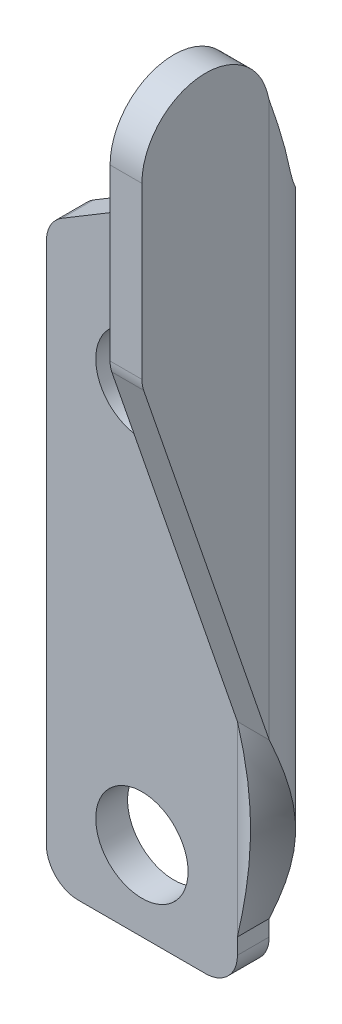
ISO-10303-21;
HEADER;
FILE_DESCRIPTION(('STEP AP214'),'2;1');
FILE_NAME('part.step','',(''),(''),'','','');
FILE_SCHEMA(('AUTOMOTIVE_DESIGN { 1 0 10303 214 1 1 1 1 }'));
ENDSEC;
DATA;
#1=APPLICATION_CONTEXT('core data for automotive mechanical design processes');
#2=APPLICATION_PROTOCOL_DEFINITION('international standard','automotive_design',2000,#1);
#3=PRODUCT_CONTEXT('',#1,'mechanical');
#4=PRODUCT('Part','Part','',(#3));
#5=PRODUCT_RELATED_PRODUCT_CATEGORY('part','',(#4));
#6=PRODUCT_DEFINITION_FORMATION('','',#4);
#7=PRODUCT_DEFINITION_CONTEXT('part definition',#1,'design');
#8=PRODUCT_DEFINITION('design','',#6,#7);
#9=PRODUCT_DEFINITION_SHAPE('','',#8);
#10=(LENGTH_UNIT() NAMED_UNIT(*) SI_UNIT(.MILLI.,.METRE.));
#11=(NAMED_UNIT(*) PLANE_ANGLE_UNIT() SI_UNIT($,.RADIAN.));
#12=(NAMED_UNIT(*) SI_UNIT($,.STERADIAN.) SOLID_ANGLE_UNIT());
#13=UNCERTAINTY_MEASURE_WITH_UNIT(LENGTH_MEASURE(1.E-05),#10,'distance_accuracy_value','');
#14=(GEOMETRIC_REPRESENTATION_CONTEXT(3) GLOBAL_UNCERTAINTY_ASSIGNED_CONTEXT((#13)) GLOBAL_UNIT_ASSIGNED_CONTEXT((#10,
#11,#12)) REPRESENTATION_CONTEXT('',''));
#15=CARTESIAN_POINT('',(0.,0.,0.));
#16=DIRECTION('',(0.,0.,1.));
#17=DIRECTION('',(1.,0.,0.));
#18=AXIS2_PLACEMENT_3D('',#15,#16,#17);
#19=CARTESIAN_POINT('',(-2.,55.,0.));
#20=DIRECTION('',(1.,0.,0.));
#21=DIRECTION('',(0.,0.,-1.));
#22=AXIS2_PLACEMENT_3D('',#19,#20,#21);
#23=PLANE('',#22);
#24=DIRECTION('',(0.,-0.945736572282818,-0.324934356211754));
#25=VECTOR('',#24,1.);
#26=CARTESIAN_POINT('',(-2.,40.,12.));
#27=LINE('',#26,#25);
#28=CARTESIAN_POINT('',(-2.,39.6841275343865,11.8914731445656));
#29=VERTEX_POINT('',#28);
#30=CARTESIAN_POINT('',(-2.,16.7156275302203,4.));
#31=VERTEX_POINT('',#30);
#32=EDGE_CURVE('E603',#29,#31,#27,.T.);
#33=ORIENTED_EDGE('',*,*,#32,.F.);
#34=CARTESIAN_POINT('',(-2.,40.33399624681,10.));
#35=DIRECTION('',(1.,0.,0.));
#36=DIRECTION('',(0.,0.,-1.));
#37=AXIS2_PLACEMENT_3D('',#34,#35,#36);
#38=CIRCLE('',#37,2.);
#39=CARTESIAN_POINT('',(-2.,40.33399624681,12.));
#40=VERTEX_POINT('',#39);
#41=EDGE_CURVE('E598',#29,#40,#38,.F.);
#42=ORIENTED_EDGE('',*,*,#41,.T.);
#43=DIRECTION('',(0.,-1.,0.));
#44=VECTOR('',#43,1.);
#45=CARTESIAN_POINT('',(-2.,55.,12.));
#46=LINE('',#45,#44);
#47=CARTESIAN_POINT('',(-2.,51.,12.));
#48=VERTEX_POINT('',#47);
#49=EDGE_CURVE('E310',#48,#40,#46,.T.);
#50=ORIENTED_EDGE('',*,*,#49,.F.);
#51=CARTESIAN_POINT('',(-2.,51.,8.));
#52=DIRECTION('',(1.,0.,0.));
#53=DIRECTION('',(0.,0.,-1.));
#54=AXIS2_PLACEMENT_3D('',#51,#52,#53);
#55=CIRCLE('',#54,4.);
#56=CARTESIAN_POINT('',(-2.,52.0352761804101,4.13629669484373));
#57=VERTEX_POINT('',#56);
#58=EDGE_CURVE('E298',#57,#48,#55,.T.);
#59=ORIENTED_EDGE('',*,*,#58,.F.);
#60=DIRECTION('',(0.,0.965925826289068,0.258819045102522));
#61=VECTOR('',#60,1.);
#62=CARTESIAN_POINT('',(-2.,52.0352761804101,4.13629669484373));
#63=LINE('',#62,#61);
#64=CARTESIAN_POINT('',(-2.,51.5266099903496,4.));
#65=VERTEX_POINT('',#64);
#66=EDGE_CURVE('E300',#65,#57,#63,.T.);
#67=ORIENTED_EDGE('',*,*,#66,.F.);
#68=DIRECTION('',(0.,-1.,0.));
#69=VECTOR('',#68,1.);
#70=CARTESIAN_POINT('',(-2.,55.,4.));
#71=LINE('',#70,#69);
#72=EDGE_CURVE('E335',#65,#31,#71,.T.);
#73=ORIENTED_EDGE('',*,*,#72,.T.);
#74=EDGE_LOOP('',(#33,#42,#50,#59,#67,#73));
#75=FACE_BOUND('',#74,.T.);
#76=ADVANCED_FACE('F73',(#75),#23,.F.);
#77=CARTESIAN_POINT('',(0.,55.,12.));
#78=DIRECTION('',(0.,0.,1.));
#79=DIRECTION('',(1.,0.,0.));
#80=AXIS2_PLACEMENT_3D('',#77,#78,#79);
#81=PLANE('',#80);
#82=ORIENTED_EDGE('',*,*,#49,.T.);
#83=DIRECTION('',(-1.,0.,0.));
#84=VECTOR('',#83,1.);
#85=CARTESIAN_POINT('',(0.,40.33399624681,12.));
#86=LINE('',#85,#84);
#87=CARTESIAN_POINT('',(0.,40.33399624681,12.));
#88=VERTEX_POINT('',#87);
#89=EDGE_CURVE('E594',#40,#88,#86,.F.);
#90=ORIENTED_EDGE('',*,*,#89,.T.);
#91=DIRECTION('',(0.,-1.,0.));
#92=VECTOR('',#91,1.);
#93=CARTESIAN_POINT('',(0.,55.,12.));
#94=LINE('',#93,#92);
#95=CARTESIAN_POINT('',(0.,51.,12.));
#96=VERTEX_POINT('',#95);
#97=EDGE_CURVE('E304',#96,#88,#94,.T.);
#98=ORIENTED_EDGE('',*,*,#97,.F.);
#99=DIRECTION('',(-1.,0.,0.));
#100=VECTOR('',#99,1.);
#101=CARTESIAN_POINT('',(0.,51.,12.));
#102=LINE('',#101,#100);
#103=EDGE_CURVE('E301',#96,#48,#102,.T.);
#104=ORIENTED_EDGE('',*,*,#103,.T.);
#105=EDGE_LOOP('',(#82,#90,#98,#104));
#106=FACE_BOUND('',#105,.T.);
#107=ADVANCED_FACE('F365',(#106),#81,.T.);
#108=CARTESIAN_POINT('',(0.,55.,0.));
#109=DIRECTION('',(1.,0.,0.));
#110=DIRECTION('',(0.,0.,-1.));
#111=AXIS2_PLACEMENT_3D('',#108,#109,#110);
#112=PLANE('',#111);
#113=ORIENTED_EDGE('',*,*,#97,.T.);
#114=CARTESIAN_POINT('',(0.,40.33399624681,10.));
#115=DIRECTION('',(1.,0.,0.));
#116=DIRECTION('',(0.,0.,-1.));
#117=AXIS2_PLACEMENT_3D('',#114,#115,#116);
#118=CIRCLE('',#117,2.);
#119=CARTESIAN_POINT('',(0.,39.6841275343865,11.8914731445656));
#120=VERTEX_POINT('',#119);
#121=EDGE_CURVE('E593',#88,#120,#118,.T.);
#122=ORIENTED_EDGE('',*,*,#121,.T.);
#123=DIRECTION('',(0.,-0.945736572282818,-0.324934356211754));
#124=VECTOR('',#123,1.);
#125=CARTESIAN_POINT('',(0.,40.,12.));
#126=LINE('',#125,#124);
#127=CARTESIAN_POINT('',(0.,16.7156275302203,4.));
#128=VERTEX_POINT('',#127);
#129=EDGE_CURVE('E286',#120,#128,#126,.T.);
#130=ORIENTED_EDGE('',*,*,#129,.T.);
#131=DIRECTION('',(0.,-1.,0.));
#132=VECTOR('',#131,1.);
#133=CARTESIAN_POINT('',(0.,55.,4.));
#134=LINE('',#133,#132);
#135=CARTESIAN_POINT('',(0.,51.5266099903496,4.));
#136=VERTEX_POINT('',#135);
#137=EDGE_CURVE('E220',#136,#128,#134,.T.);
#138=ORIENTED_EDGE('',*,*,#137,.F.);
#139=DIRECTION('',(0.,0.965925826289068,0.258819045102522));
#140=VECTOR('',#139,1.);
#141=CARTESIAN_POINT('',(0.,52.0352761804101,4.13629669484373));
#142=LINE('',#141,#140);
#143=CARTESIAN_POINT('',(0.,52.0352761804101,4.13629669484373));
#144=VERTEX_POINT('',#143);
#145=EDGE_CURVE('E297',#136,#144,#142,.T.);
#146=ORIENTED_EDGE('',*,*,#145,.T.);
#147=CARTESIAN_POINT('',(0.,51.,8.));
#148=DIRECTION('',(1.,0.,0.));
#149=DIRECTION('',(0.,0.,-1.));
#150=AXIS2_PLACEMENT_3D('',#147,#148,#149);
#151=CIRCLE('',#150,4.);
#152=EDGE_CURVE('E293',#144,#96,#151,.T.);
#153=ORIENTED_EDGE('',*,*,#152,.T.);
#154=EDGE_LOOP('',(#113,#122,#130,#138,#146,#153));
#155=FACE_BOUND('',#154,.T.);
#156=ADVANCED_FACE('F370',(#155),#112,.T.);
#157=CARTESIAN_POINT('',(0.,51.,8.));
#158=DIRECTION('',(-1.,0.,0.));
#159=DIRECTION('',(0.,0.,1.));
#160=AXIS2_PLACEMENT_3D('',#157,#158,#159);
#161=CYLINDRICAL_SURFACE('',#160,4.);
#162=ORIENTED_EDGE('',*,*,#58,.T.);
#163=ORIENTED_EDGE('',*,*,#103,.F.);
#164=ORIENTED_EDGE('',*,*,#152,.F.);
#165=DIRECTION('',(-1.,0.,0.));
#166=VECTOR('',#165,1.);
#167=CARTESIAN_POINT('',(0.,52.0352761804101,4.13629669484373));
#168=LINE('',#167,#166);
#169=EDGE_CURVE('E296',#144,#57,#168,.T.);
#170=ORIENTED_EDGE('',*,*,#169,.T.);
#171=EDGE_LOOP('',(#162,#163,#164,#170));
#172=FACE_BOUND('',#171,.T.);
#173=ADVANCED_FACE('F348',(#172),#161,.T.);
#174=CARTESIAN_POINT('',(0.,52.0352761804101,4.13629669484373));
#175=DIRECTION('',(0.,-0.258819045102522,0.965925826289068));
#176=DIRECTION('',(0.,0.965925826289068,0.258819045102522));
#177=AXIS2_PLACEMENT_3D('',#174,#175,#176);
#178=PLANE('',#177);
#179=CARTESIAN_POINT('',(-2.,51.5266099903496,4.));
#180=CARTESIAN_POINT('',(0.,51.5266099903496,4.));
#181=B_SPLINE_CURVE_WITH_KNOTS('',1,(#179,#180),.UNSPECIFIED.,.F.,.F.,(2,2),(0.,1.),.UNSPECIFIED.);
#182=EDGE_CURVE('E329',#65,#136,#181,.T.);
#183=ORIENTED_EDGE('',*,*,#182,.F.);
#184=ORIENTED_EDGE('',*,*,#66,.T.);
#185=ORIENTED_EDGE('',*,*,#169,.F.);
#186=ORIENTED_EDGE('',*,*,#145,.F.);
#187=EDGE_LOOP('',(#183,#184,#185,#186));
#188=FACE_BOUND('',#187,.T.);
#189=ADVANCED_FACE('F337',(#188),#178,.F.);
#190=CARTESIAN_POINT('',(0.,40.,12.));
#191=DIRECTION('',(0.,0.324934356211754,-0.945736572282818));
#192=DIRECTION('',(0.,-0.945736572282818,-0.324934356211754));
#193=AXIS2_PLACEMENT_3D('',#190,#191,#192);
#194=PLANE('',#193);
#195=ORIENTED_EDGE('',*,*,#129,.F.);
#196=DIRECTION('',(-1.,0.,0.));
#197=VECTOR('',#196,1.);
#198=CARTESIAN_POINT('',(-2.,39.6841275343865,11.8914731445656));
#199=LINE('',#198,#197);
#200=EDGE_CURVE('E600',#120,#29,#199,.T.);
#201=ORIENTED_EDGE('',*,*,#200,.T.);
#202=ORIENTED_EDGE('',*,*,#32,.T.);
#203=CARTESIAN_POINT('',(0.,16.7156275302203,4.));
#204=CARTESIAN_POINT('',(-2.,16.7156275302203,4.));
#205=B_SPLINE_CURVE_WITH_KNOTS('',1,(#203,#204),.UNSPECIFIED.,.F.,.F.,(2,2),(0.,1.),.UNSPECIFIED.);
#206=EDGE_CURVE('E316',#128,#31,#205,.T.);
#207=ORIENTED_EDGE('',*,*,#206,.F.);
#208=EDGE_LOOP('',(#195,#201,#202,#207));
#209=FACE_BOUND('',#208,.T.);
#210=ADVANCED_FACE('F347',(#209),#194,.F.);
#211=CARTESIAN_POINT('',(-10.,30.,2.));
#212=DIRECTION('',(0.,0.,1.));
#213=DIRECTION('',(1.,0.,0.));
#214=AXIS2_PLACEMENT_3D('',#211,#212,#213);
#215=CYLINDRICAL_SURFACE('',#214,2.9);
#216=CARTESIAN_POINT('',(-10.,30.,0.));
#217=DIRECTION('',(0.,0.,1.));
#218=DIRECTION('',(1.,0.,0.));
#219=AXIS2_PLACEMENT_3D('',#216,#217,#218);
#220=CIRCLE('',#219,2.9);
#221=CARTESIAN_POINT('',(-7.1,30.,0.));
#222=VERTEX_POINT('',#221);
#223=EDGE_CURVE('E404',#222,#222,#220,.T.);
#224=ORIENTED_EDGE('',*,*,#223,.F.);
#225=EDGE_LOOP('',(#224));
#226=FACE_BOUND('',#225,.T.);
#227=CARTESIAN_POINT('',(-10.,30.,2.));
#228=DIRECTION('',(0.,0.,1.));
#229=DIRECTION('',(1.,0.,0.));
#230=AXIS2_PLACEMENT_3D('',#227,#228,#229);
#231=CIRCLE('',#230,2.9);
#232=CARTESIAN_POINT('',(-7.1,30.,2.));
#233=VERTEX_POINT('',#232);
#234=EDGE_CURVE('E410',#233,#233,#231,.T.);
#235=ORIENTED_EDGE('',*,*,#234,.T.);
#236=EDGE_LOOP('',(#235));
#237=FACE_BOUND('',#236,.T.);
#238=ADVANCED_FACE('F804',(#226,#237),#215,.F.);
#239=CARTESIAN_POINT('',(-10.,5.,2.));
#240=DIRECTION('',(0.,0.,1.));
#241=DIRECTION('',(1.,0.,0.));
#242=AXIS2_PLACEMENT_3D('',#239,#240,#241);
#243=CYLINDRICAL_SURFACE('',#242,2.9);
#244=CARTESIAN_POINT('',(-10.,5.,0.));
#245=DIRECTION('',(0.,0.,1.));
#246=DIRECTION('',(1.,0.,0.));
#247=AXIS2_PLACEMENT_3D('',#244,#245,#246);
#248=CIRCLE('',#247,2.9);
#249=CARTESIAN_POINT('',(-7.1,5.,0.));
#250=VERTEX_POINT('',#249);
#251=EDGE_CURVE('E232',#250,#250,#248,.T.);
#252=ORIENTED_EDGE('',*,*,#251,.F.);
#253=EDGE_LOOP('',(#252));
#254=FACE_BOUND('',#253,.T.);
#255=CARTESIAN_POINT('',(-10.,5.,2.));
#256=DIRECTION('',(0.,0.,1.));
#257=DIRECTION('',(1.,0.,0.));
#258=AXIS2_PLACEMENT_3D('',#255,#256,#257);
#259=CIRCLE('',#258,2.9);
#260=CARTESIAN_POINT('',(-7.1,5.,2.));
#261=VERTEX_POINT('',#260);
#262=EDGE_CURVE('E414',#261,#261,#259,.T.);
#263=ORIENTED_EDGE('',*,*,#262,.T.);
#264=EDGE_LOOP('',(#263));
#265=FACE_BOUND('',#264,.T.);
#266=ADVANCED_FACE('F793',(#254,#265),#243,.F.);
#267=CARTESIAN_POINT('',(-16.,55.,2.));
#268=DIRECTION('',(-1.,0.,0.));
#269=DIRECTION('',(0.,0.,1.));
#270=AXIS2_PLACEMENT_3D('',#267,#268,#269);
#271=PLANE('',#270);
#272=DIRECTION('',(0.,-1.,0.));
#273=VECTOR('',#272,1.);
#274=CARTESIAN_POINT('',(-16.,55.,0.));
#275=LINE('',#274,#273);
#276=CARTESIAN_POINT('',(-16.,34.8690355517294,0.));
#277=VERTEX_POINT('',#276);
#278=CARTESIAN_POINT('',(-16.,2.,0.));
#279=VERTEX_POINT('',#278);
#280=EDGE_CURVE('E261',#277,#279,#275,.T.);
#281=ORIENTED_EDGE('',*,*,#280,.T.);
#282=DIRECTION('',(0.,0.,-1.));
#283=VECTOR('',#282,1.);
#284=CARTESIAN_POINT('',(-16.,2.,2.));
#285=LINE('',#284,#283);
#286=CARTESIAN_POINT('',(-16.,2.,2.));
#287=VERTEX_POINT('',#286);
#288=EDGE_CURVE('E81',#279,#287,#285,.F.);
#289=ORIENTED_EDGE('',*,*,#288,.T.);
#290=DIRECTION('',(0.,-1.,0.));
#291=VECTOR('',#290,1.);
#292=CARTESIAN_POINT('',(-16.,55.,2.));
#293=LINE('',#292,#291);
#294=CARTESIAN_POINT('',(-16.,34.8690355517294,2.));
#295=VERTEX_POINT('',#294);
#296=EDGE_CURVE('E207',#295,#287,#293,.T.);
#297=ORIENTED_EDGE('',*,*,#296,.F.);
#298=DIRECTION('',(0.,0.,1.));
#299=VECTOR('',#298,1.);
#300=CARTESIAN_POINT('',(-16.,34.8690355517294,0.));
#301=LINE('',#300,#299);
#302=EDGE_CURVE('E95',#295,#277,#301,.F.);
#303=ORIENTED_EDGE('',*,*,#302,.T.);
#304=EDGE_LOOP('',(#281,#289,#297,#303));
#305=FACE_BOUND('',#304,.T.);
#306=ADVANCED_FACE('F260',(#305),#271,.T.);
#307=CARTESIAN_POINT('',(-2.,0.,4.));
#308=DIRECTION('',(0.,-1.,0.));
#309=DIRECTION('',(0.,0.,-1.));
#310=AXIS2_PLACEMENT_3D('',#307,#308,#309);
#311=PLANE('',#310);
#312=DIRECTION('',(1.,0.,0.));
#313=VECTOR('',#312,1.);
#314=CARTESIAN_POINT('',(-16.,0.,0.));
#315=LINE('',#314,#313);
#316=CARTESIAN_POINT('',(-14.,0.,0.));
#317=VERTEX_POINT('',#316);
#318=CARTESIAN_POINT('',(-6.,0.,0.));
#319=VERTEX_POINT('',#318);
#320=EDGE_CURVE('E239',#317,#319,#315,.T.);
#321=ORIENTED_EDGE('',*,*,#320,.T.);
#322=DIRECTION('',(0.,0.,1.));
#323=VECTOR('',#322,1.);
#324=CARTESIAN_POINT('',(-6.,0.,2.));
#325=LINE('',#324,#323);
#326=CARTESIAN_POINT('',(-6.,0.,2.));
#327=VERTEX_POINT('',#326);
#328=EDGE_CURVE('E279',#319,#327,#325,.T.);
#329=ORIENTED_EDGE('',*,*,#328,.T.);
#330=DIRECTION('',(1.,0.,0.));
#331=VECTOR('',#330,1.);
#332=CARTESIAN_POINT('',(-16.,0.,2.));
#333=LINE('',#332,#331);
#334=CARTESIAN_POINT('',(-14.,0.,2.));
#335=VERTEX_POINT('',#334);
#336=EDGE_CURVE('E271',#335,#327,#333,.T.);
#337=ORIENTED_EDGE('',*,*,#336,.F.);
#338=DIRECTION('',(0.,0.,-1.));
#339=VECTOR('',#338,1.);
#340=CARTESIAN_POINT('',(-14.,0.,4.));
#341=LINE('',#340,#339);
#342=EDGE_CURVE('E276',#335,#317,#341,.T.);
#343=ORIENTED_EDGE('',*,*,#342,.T.);
#344=EDGE_LOOP('',(#321,#329,#337,#343));
#345=FACE_BOUND('',#344,.T.);
#346=ADVANCED_FACE('F592',(#345),#311,.T.);
#347=CARTESIAN_POINT('',(-16.,55.,0.));
#348=DIRECTION('',(0.,0.,-1.));
#349=DIRECTION('',(-1.,0.,0.));
#350=AXIS2_PLACEMENT_3D('',#347,#348,#349);
#351=PLANE('',#350);
#352=DIRECTION('',(0.,-1.,0.));
#353=VECTOR('',#352,1.);
#354=CARTESIAN_POINT('',(-4.,0.,0.));
#355=LINE('',#354,#353);
#356=CARTESIAN_POINT('',(-4.,3.,0.));
#357=VERTEX_POINT('',#356);
#358=CARTESIAN_POINT('',(-4.,2.,0.));
#359=VERTEX_POINT('',#358);
#360=EDGE_CURVE('E227',#357,#359,#355,.T.);
#361=ORIENTED_EDGE('',*,*,#360,.T.);
#362=CARTESIAN_POINT('',(-6.,2.,0.));
#363=DIRECTION('',(0.,0.,-1.));
#364=DIRECTION('',(-1.,0.,0.));
#365=AXIS2_PLACEMENT_3D('',#362,#363,#364);
#366=CIRCLE('',#365,2.);
#367=EDGE_CURVE('E256',#359,#319,#366,.T.);
#368=ORIENTED_EDGE('',*,*,#367,.T.);
#369=ORIENTED_EDGE('',*,*,#320,.F.);
#370=CARTESIAN_POINT('',(-14.,2.,0.));
#371=DIRECTION('',(0.,0.,-1.));
#372=DIRECTION('',(-1.,0.,0.));
#373=AXIS2_PLACEMENT_3D('',#370,#371,#372);
#374=CIRCLE('',#373,2.);
#375=EDGE_CURVE('E88',#317,#279,#374,.T.);
#376=ORIENTED_EDGE('',*,*,#375,.T.);
#377=ORIENTED_EDGE('',*,*,#280,.F.);
#378=CARTESIAN_POINT('',(-14.,34.8690355517294,0.));
#379=DIRECTION('',(0.,0.,-1.));
#380=DIRECTION('',(-1.,0.,0.));
#381=AXIS2_PLACEMENT_3D('',#378,#379,#380);
#382=CIRCLE('',#381,2.);
#383=CARTESIAN_POINT('',(-15.0308307948093,36.5829164905559,0.));
#384=VERTEX_POINT('',#383);
#385=EDGE_CURVE('E253',#277,#384,#382,.T.);
#386=ORIENTED_EDGE('',*,*,#385,.T.);
#387=DIRECTION('',(0.856940469413254,0.515415397404649,0.));
#388=VECTOR('',#387,1.);
#389=CARTESIAN_POINT('',(-16.,36.,0.));
#390=LINE('',#389,#388);
#391=CARTESIAN_POINT('',(-4.,43.2175197573417,0.));
#392=VERTEX_POINT('',#391);
#393=EDGE_CURVE('E237',#384,#392,#390,.T.);
#394=ORIENTED_EDGE('',*,*,#393,.T.);
#395=DIRECTION('',(0.,-1.,0.));
#396=VECTOR('',#395,1.);
#397=CARTESIAN_POINT('',(-4.,55.,0.));
#398=LINE('',#397,#396);
#399=EDGE_CURVE('E218',#392,#357,#398,.T.);
#400=ORIENTED_EDGE('',*,*,#399,.T.);
#401=EDGE_LOOP('',(#361,#368,#369,#376,#377,#386,#394,#400));
#402=FACE_BOUND('',#401,.T.);
#403=ORIENTED_EDGE('',*,*,#251,.T.);
#404=EDGE_LOOP('',(#403));
#405=FACE_BOUND('',#404,.T.);
#406=ORIENTED_EDGE('',*,*,#223,.T.);
#407=EDGE_LOOP('',(#406));
#408=FACE_BOUND('',#407,.T.);
#409=ADVANCED_FACE('F234',(#402,#405,#408),#351,.T.);
#410=CARTESIAN_POINT('',(-4.,0.,0.));
#411=DIRECTION('',(-1.,0.,0.));
#412=DIRECTION('',(0.,-1.,0.));
#413=AXIS2_PLACEMENT_3D('',#410,#411,#412);
#414=PLANE('',#413);
#415=DIRECTION('',(0.,-1.,0.));
#416=VECTOR('',#415,1.);
#417=CARTESIAN_POINT('',(-4.,0.,2.));
#418=LINE('',#417,#416);
#419=CARTESIAN_POINT('',(-4.,3.,2.));
#420=VERTEX_POINT('',#419);
#421=CARTESIAN_POINT('',(-4.,2.,2.));
#422=VERTEX_POINT('',#421);
#423=EDGE_CURVE('E208',#420,#422,#418,.T.);
#424=ORIENTED_EDGE('',*,*,#423,.T.);
#425=DIRECTION('',(0.,0.,1.));
#426=VECTOR('',#425,1.);
#427=CARTESIAN_POINT('',(-4.,2.,0.));
#428=LINE('',#427,#426);
#429=EDGE_CURVE('E230',#422,#359,#428,.F.);
#430=ORIENTED_EDGE('',*,*,#429,.T.);
#431=ORIENTED_EDGE('',*,*,#360,.F.);
#432=CARTESIAN_POINT('',(-4.,3.,2.));
#433=CARTESIAN_POINT('',(-4.,3.,0.));
#434=B_SPLINE_CURVE_WITH_KNOTS('',1,(#432,#433),.UNSPECIFIED.,.F.,.F.,(2,2),(0.,1.),.UNSPECIFIED.);
#435=EDGE_CURVE('E191',#357,#420,#434,.F.);
#436=ORIENTED_EDGE('',*,*,#435,.T.);
#437=EDGE_LOOP('',(#424,#430,#431,#436));
#438=FACE_BOUND('',#437,.T.);
#439=ADVANCED_FACE('F228',(#438),#414,.F.);
#440=CARTESIAN_POINT('',(-16.,55.,2.));
#441=DIRECTION('',(0.,0.,-1.));
#442=DIRECTION('',(-1.,0.,0.));
#443=AXIS2_PLACEMENT_3D('',#440,#441,#442);
#444=PLANE('',#443);
#445=ORIENTED_EDGE('',*,*,#262,.F.);
#446=EDGE_LOOP('',(#445));
#447=FACE_BOUND('',#446,.T.);
#448=ORIENTED_EDGE('',*,*,#234,.F.);
#449=EDGE_LOOP('',(#448));
#450=FACE_BOUND('',#449,.T.);
#451=ORIENTED_EDGE('',*,*,#336,.T.);
#452=CARTESIAN_POINT('',(-6.,2.,2.));
#453=DIRECTION('',(0.,0.,-1.));
#454=DIRECTION('',(-1.,0.,0.));
#455=AXIS2_PLACEMENT_3D('',#452,#453,#454);
#456=CIRCLE('',#455,2.);
#457=EDGE_CURVE('E277',#327,#422,#456,.F.);
#458=ORIENTED_EDGE('',*,*,#457,.T.);
#459=ORIENTED_EDGE('',*,*,#423,.F.);
#460=DIRECTION('',(0.,-1.,0.));
#461=VECTOR('',#460,1.);
#462=CARTESIAN_POINT('',(-4.,55.,2.));
#463=LINE('',#462,#461);
#464=CARTESIAN_POINT('',(-4.,43.2175197573417,2.));
#465=VERTEX_POINT('',#464);
#466=EDGE_CURVE('E407',#465,#420,#463,.T.);
#467=ORIENTED_EDGE('',*,*,#466,.F.);
#468=DIRECTION('',(0.856940469413254,0.515415397404649,0.));
#469=VECTOR('',#468,1.);
#470=CARTESIAN_POINT('',(-16.,36.,2.));
#471=LINE('',#470,#469);
#472=CARTESIAN_POINT('',(-15.0308307948093,36.5829164905559,2.));
#473=VERTEX_POINT('',#472);
#474=EDGE_CURVE('E282',#473,#465,#471,.T.);
#475=ORIENTED_EDGE('',*,*,#474,.F.);
#476=CARTESIAN_POINT('',(-14.,34.8690355517294,2.));
#477=DIRECTION('',(0.,0.,-1.));
#478=DIRECTION('',(-1.,0.,0.));
#479=AXIS2_PLACEMENT_3D('',#476,#477,#478);
#480=CIRCLE('',#479,2.);
#481=EDGE_CURVE('E270',#473,#295,#480,.F.);
#482=ORIENTED_EDGE('',*,*,#481,.T.);
#483=ORIENTED_EDGE('',*,*,#296,.T.);
#484=CARTESIAN_POINT('',(-14.,2.,2.));
#485=DIRECTION('',(0.,0.,-1.));
#486=DIRECTION('',(-1.,0.,0.));
#487=AXIS2_PLACEMENT_3D('',#484,#485,#486);
#488=CIRCLE('',#487,2.);
#489=EDGE_CURVE('E267',#287,#335,#488,.F.);
#490=ORIENTED_EDGE('',*,*,#489,.T.);
#491=EDGE_LOOP('',(#451,#458,#459,#467,#475,#482,#483,#490));
#492=FACE_BOUND('',#491,.T.);
#493=ADVANCED_FACE('F266',(#447,#450,#492),#444,.F.);
#494=CARTESIAN_POINT('',(-16.,36.,0.));
#495=DIRECTION('',(0.515415397404649,-0.856940469413254,0.));
#496=DIRECTION('',(0.856940469413254,0.515415397404649,0.));
#497=AXIS2_PLACEMENT_3D('',#494,#495,#496);
#498=PLANE('',#497);
#499=ORIENTED_EDGE('',*,*,#393,.F.);
#500=DIRECTION('',(0.,0.,1.));
#501=VECTOR('',#500,1.);
#502=CARTESIAN_POINT('',(-15.0308307948093,36.5829164905559,2.));
#503=LINE('',#502,#501);
#504=EDGE_CURVE('E12',#384,#473,#503,.T.);
#505=ORIENTED_EDGE('',*,*,#504,.T.);
#506=ORIENTED_EDGE('',*,*,#474,.T.);
#507=CARTESIAN_POINT('',(-4.,43.2175197573417,0.));
#508=CARTESIAN_POINT('',(-4.,43.2175197573417,2.));
#509=B_SPLINE_CURVE_WITH_KNOTS('',1,(#507,#508),.UNSPECIFIED.,.F.,.F.,(2,2),(0.,1.),.UNSPECIFIED.);
#510=EDGE_CURVE('E411',#392,#465,#509,.T.);
#511=ORIENTED_EDGE('',*,*,#510,.F.);
#512=EDGE_LOOP('',(#499,#505,#506,#511));
#513=FACE_BOUND('',#512,.T.);
#514=ADVANCED_FACE('F380',(#513),#498,.F.);
#515=CARTESIAN_POINT('',(0.,16.7156275302203,4.));
#516=CARTESIAN_POINT('',(0.,15.572622824222,3.47638484940323));
#517=CARTESIAN_POINT('',(-0.104109293326738,14.4296896085169,2.95300846256288));
#518=CARTESIAN_POINT('',(-0.50485444658297,12.1437516868135,1.9855240785164));
#519=CARTESIAN_POINT('',(-0.801332630407281,11.0007827259618,1.54181312010034));
#520=CARTESIAN_POINT('',(-1.54181312010034,8.71484480425846,0.801332630407279));
#521=CARTESIAN_POINT('',(-1.9855240785164,7.57187584340677,0.504854446582968));
#522=CARTESIAN_POINT('',(-2.95300846256288,5.28593792170339,0.104109293326737));
#523=CARTESIAN_POINT('',(-3.47638484940324,4.14300470599827,0.));
#524=CARTESIAN_POINT('',(-4.,3.,0.));
#525=CARTESIAN_POINT('',(-2.,16.7156275302203,4.));
#526=CARTESIAN_POINT('',(-2.,15.5726482966738,3.738198259219));
#527=CARTESIAN_POINT('',(-2.05205464666337,14.4296896085169,3.47650423128144));
#528=CARTESIAN_POINT('',(-2.25242722329148,12.1437516868135,2.9927620392582));
#529=CARTESIAN_POINT('',(-2.40066631520364,11.0007827259618,2.77090656005017));
#530=CARTESIAN_POINT('',(-2.77090656005017,8.71484480425846,2.40066631520364));
#531=CARTESIAN_POINT('',(-2.9927620392582,7.57187584340677,2.25242722329148));
#532=CARTESIAN_POINT('',(-3.47650423128144,5.28593792170339,2.05205464666337));
#533=CARTESIAN_POINT('',(-3.738198259219,4.14297923354652,2.));
#534=CARTESIAN_POINT('',(-4.,3.,2.));
#535=B_SPLINE_SURFACE_WITH_KNOTS('',1,3,((#515,#516,#517,#518,#519,#520,#521,#522,#523,#524),
(#525,#526,#527,#528,#529,#530,#531,#532,#533,#534)),.UNSPECIFIED.,.F.,.F.,.F.,(2,2),(4,2,2,2,
4),(0.,1.),(0.,0.25,0.5,0.75,1.),.UNSPECIFIED.);
#536=CARTESIAN_POINT('',(-2.,16.7156275302203,4.));
#537=CARTESIAN_POINT('',(-2.,15.5726482966738,3.738198259219));
#538=CARTESIAN_POINT('',(-2.05205464666337,14.4296896085169,3.47650423128144));
#539=CARTESIAN_POINT('',(-2.25242722329148,12.1437516868135,2.9927620392582));
#540=CARTESIAN_POINT('',(-2.40066631520364,11.0007827259618,2.77090656005017));
#541=CARTESIAN_POINT('',(-2.77090656005017,8.71484480425846,2.40066631520364));
#542=CARTESIAN_POINT('',(-2.9927620392582,7.57187584340677,2.25242722329148));
#543=CARTESIAN_POINT('',(-3.47650423128144,5.28593792170339,2.05205464666337));
#544=CARTESIAN_POINT('',(-3.738198259219,4.14297923354652,2.));
#545=CARTESIAN_POINT('',(-4.,3.,2.));
#546=B_SPLINE_CURVE_WITH_KNOTS('',3,(#536,#537,#538,#539,#540,#541,#542,#543,#544,#545),
.UNSPECIFIED.,.F.,.F.,(4,2,2,2,4),(0.,0.25,0.5,0.75,1.),.UNSPECIFIED.);
#547=EDGE_CURVE('E200',#31,#420,#546,.T.);
#548=CARTESIAN_POINT('',(-4.,3.,0.));
#549=CARTESIAN_POINT('',(-3.47638484940324,4.14300470599827,0.));
#550=CARTESIAN_POINT('',(-2.95300846256288,5.28593792170339,0.104109293326737));
#551=CARTESIAN_POINT('',(-1.9855240785164,7.57187584340677,0.504854446582968));
#552=CARTESIAN_POINT('',(-1.54181312010034,8.71484480425846,0.801332630407279));
#553=CARTESIAN_POINT('',(-0.801332630407281,11.0007827259618,1.54181312010034));
#554=CARTESIAN_POINT('',(-0.50485444658297,12.1437516868135,1.9855240785164));
#555=CARTESIAN_POINT('',(-0.104109293326738,14.4296896085169,2.95300846256288));
#556=CARTESIAN_POINT('',(0.,15.572622824222,3.47638484940323));
#557=CARTESIAN_POINT('',(0.,16.7156275302203,4.));
#558=B_SPLINE_CURVE_WITH_KNOTS('',3,(#548,#549,#550,#551,#552,#553,#554,#555,#556,#557),
.UNSPECIFIED.,.F.,.F.,(4,2,2,2,4),(0.,0.25,0.5,0.75,1.),.UNSPECIFIED.);
#559=EDGE_CURVE('E196',#128,#357,#558,.F.);
#560=ORIENTED_EDGE('',*,*,#206,.T.);
#561=ORIENTED_EDGE('',*,*,#547,.T.);
#562=ORIENTED_EDGE('',*,*,#435,.F.);
#563=ORIENTED_EDGE('',*,*,#559,.F.);
#564=EDGE_LOOP('',(#560,#561,#562,#563));
#565=FACE_BOUND('',#564,.T.);
#566=ADVANCED_FACE('F195',(#565),#535,.T.);
#567=CARTESIAN_POINT('',(-4.,43.2175197573417,0.));
#568=CARTESIAN_POINT('',(-3.2969608498203,43.5346571921296,0.));
#569=CARTESIAN_POINT('',(-2.59770810008145,43.8504250776799,0.188459435594551));
#570=CARTESIAN_POINT('',(-1.98988792334389,44.1675625124678,0.541756307129116));
#571=CARTESIAN_POINT('',(-4.,43.2175197573417,2.));
#572=CARTESIAN_POINT('',(-3.64861940843795,43.5345318025849,2.));
#573=CARTESIAN_POINT('',(-3.29873389031362,43.8505504672247,2.09429956091419));
#574=CARTESIAN_POINT('',(-2.99494396167194,44.1675625124678,2.27087815356456));
#575=B_SPLINE_SURFACE_WITH_KNOTS('',1,3,((#567,#568,#569,#570),(#571,#572,#573,#574)),
.UNSPECIFIED.,.F.,.F.,.F.,(2,2),(4,4),(0.,1.),(0.,1.),.UNSPECIFIED.);
#576=CARTESIAN_POINT('',(-4.,43.2175197573417,2.));
#577=CARTESIAN_POINT('',(-3.64861940843795,43.5345318025849,2.));
#578=CARTESIAN_POINT('',(-3.29873389031362,43.8505504672247,2.09429956091419));
#579=CARTESIAN_POINT('',(-2.99494396167194,44.1675625124678,2.27087815356456));
#580=B_SPLINE_CURVE_WITH_KNOTS('',3,(#576,#577,#578,#579),.UNSPECIFIED.,.F.,.F.,(4,4),(0.,1.),.UNSPECIFIED.);
#581=CARTESIAN_POINT('',(-2.99494396167194,44.1675625124678,2.27087815356456));
#582=VERTEX_POINT('',#581);
#583=EDGE_CURVE('E581',#465,#582,#580,.T.);
#584=CARTESIAN_POINT('',(-2.99494396167194,44.1675625124678,2.27087815356456));
#585=CARTESIAN_POINT('',(-1.98988792334389,44.1675625124678,0.541756307129116));
#586=B_SPLINE_CURVE_WITH_KNOTS('',1,(#584,#585),.UNSPECIFIED.,.F.,.F.,(2,2),(0.,1.),.UNSPECIFIED.);
#587=CARTESIAN_POINT('',(-1.98988792334389,44.1675625124678,0.541756307129116));
#588=VERTEX_POINT('',#587);
#589=EDGE_CURVE('E481',#582,#588,#586,.T.);
#590=CARTESIAN_POINT('',(-1.98988792334389,44.1675625124678,0.541756307129116));
#591=CARTESIAN_POINT('',(-2.59770810008145,43.8504250776799,0.188459435594551));
#592=CARTESIAN_POINT('',(-3.2969608498203,43.5346571921296,0.));
#593=CARTESIAN_POINT('',(-4.,43.2175197573417,0.));
#594=B_SPLINE_CURVE_WITH_KNOTS('',3,(#590,#591,#592,#593),.UNSPECIFIED.,.F.,.F.,(4,4),(0.,1.),.UNSPECIFIED.);
#595=EDGE_CURVE('E222',#392,#588,#594,.F.);
#596=ORIENTED_EDGE('',*,*,#510,.T.);
#597=ORIENTED_EDGE('',*,*,#583,.T.);
#598=ORIENTED_EDGE('',*,*,#589,.T.);
#599=ORIENTED_EDGE('',*,*,#595,.F.);
#600=EDGE_LOOP('',(#596,#597,#598,#599));
#601=FACE_BOUND('',#600,.T.);
#602=ADVANCED_FACE('F486',(#601),#575,.T.);
#603=CARTESIAN_POINT('',(-1.98988792334389,44.1675625124678,0.541756307129116));
#604=CARTESIAN_POINT('',(-1.69422674928658,44.3542497889382,0.713610042537088));
#605=CARTESIAN_POINT('',(-1.46509107379527,44.5269444992899,0.896379657625495));
#606=CARTESIAN_POINT('',(-1.19906442471772,44.765786970008,1.14179855038934));
#607=CARTESIAN_POINT('',(-1.12330213930746,44.8419906803141,1.21903967672664));
#608=CARTESIAN_POINT('',(-1.02616880724709,44.9511805758737,1.32444197178547));
#609=CARTESIAN_POINT('',(-0.996544464764134,44.9867245960769,1.35784604450624));
#610=CARTESIAN_POINT('',(-0.955910286652907,45.0387617089067,1.40501474257329));
#611=CARTESIAN_POINT('',(-0.942999562828189,45.0558942602709,1.4202487779214));
#612=CARTESIAN_POINT('',(-0.924546361297418,45.0812733579483,1.44232978545665));
#613=CARTESIAN_POINT('',(-0.91854746316192,45.089679768946,1.44956182079923));
#614=CARTESIAN_POINT('',(-0.909772809068175,45.1022094531004,1.46021318431974));
#615=CARTESIAN_POINT('',(-0.90688520802525,45.1063726924282,1.46373085966199));
#616=CARTESIAN_POINT('',(-0.901183831179827,45.1146725269696,1.47069997421766));
#617=CARTESIAN_POINT('',(-0.899415659148534,45.1172567433706,1.47286456737914));
#618=CARTESIAN_POINT('',(-0.6509315895677,45.4861741213774,1.77867901851309));
#619=CARTESIAN_POINT('',(-0.493815448809953,45.9654978828612,2.05875179277753));
#620=CARTESIAN_POINT('',(-0.38714242664031,46.5600482097108,2.28324138137666));
#621=CARTESIAN_POINT('',(-2.99494396167194,44.1675625124678,2.27087815356456));
#622=CARTESIAN_POINT('',(-2.84717001920655,44.3541782555739,2.35677209648625));
#623=CARTESIAN_POINT('',(-2.73254553689763,44.5269444992899,2.44818982881275));
#624=CARTESIAN_POINT('',(-2.59953221235886,44.765786970008,2.57089927519467));
#625=CARTESIAN_POINT('',(-2.56165106965373,44.8419906803141,2.60951983836332));
#626=CARTESIAN_POINT('',(-2.51308440362354,44.9511805758737,2.66222098589274));
#627=CARTESIAN_POINT('',(-2.49827223238207,44.9867245960769,2.67892302225312));
#628=CARTESIAN_POINT('',(-2.47795514332645,45.0387617089067,2.70250737128664));
#629=CARTESIAN_POINT('',(-2.47149978141409,45.0558942602709,2.7101243889607));
#630=CARTESIAN_POINT('',(-2.46227318064871,45.0812733579483,2.72116489272833));
#631=CARTESIAN_POINT('',(-2.45927373158096,45.089679768946,2.72478091039961));
#632=CARTESIAN_POINT('',(-2.45488640453409,45.1022094531004,2.73010659215987));
#633=CARTESIAN_POINT('',(-2.45344260401262,45.1063726924282,2.731865429831));
#634=CARTESIAN_POINT('',(-2.45059191558991,45.1146725269696,2.73534998710883));
#635=CARTESIAN_POINT('',(-2.44970782957427,45.1172567433706,2.73643228368957));
#636=CARTESIAN_POINT('',(-2.32546579478385,45.4861741213774,2.88933950925655));
#637=CARTESIAN_POINT('',(-2.24692610711987,45.9652929678991,3.02933721061779));
#638=CARTESIAN_POINT('',(-2.19357121332015,46.5600482097108,3.14162069068833));
#639=B_SPLINE_SURFACE_WITH_KNOTS('',1,3,((#603,#604,#605,#606,#607,#608,#609,#610,#611,#612,
#613,#614,#615,#616,#617,#618,#619,#620),(#621,#622,#623,#624,#625,#626,#627,#628,#629,#630,
#631,#632,#633,#634,#635,#636,#637,#638)),.UNSPECIFIED.,.F.,.F.,.F.,(2,2),(4,2,2,2,2,2,2,2,4),
(0.,1.),(0.,0.25,0.375,0.4375,0.46875,0.484375,0.4921875,0.5,1.),.UNSPECIFIED.);
#640=CARTESIAN_POINT('',(-2.99494396167194,44.1675625124678,2.27087815356456));
#641=CARTESIAN_POINT('',(-2.84717001920655,44.3541782555739,2.35677209648625));
#642=CARTESIAN_POINT('',(-2.73254553689763,44.5269444992899,2.44818982881275));
#643=CARTESIAN_POINT('',(-2.59953221235886,44.765786970008,2.57089927519467));
#644=CARTESIAN_POINT('',(-2.56165106965373,44.8419906803141,2.60951983836332));
#645=CARTESIAN_POINT('',(-2.51308440362354,44.9511805758737,2.66222098589274));
#646=CARTESIAN_POINT('',(-2.49827223238207,44.9867245960769,2.67892302225312));
#647=CARTESIAN_POINT('',(-2.47795514332645,45.0387617089067,2.70250737128664));
#648=CARTESIAN_POINT('',(-2.47149978141409,45.0558942602709,2.7101243889607));
#649=CARTESIAN_POINT('',(-2.46227318064871,45.0812733579483,2.72116489272833));
#650=CARTESIAN_POINT('',(-2.45927373158096,45.089679768946,2.72478091039961));
#651=CARTESIAN_POINT('',(-2.45488640453409,45.1022094531004,2.73010659215987));
#652=CARTESIAN_POINT('',(-2.45344260401262,45.1063726924282,2.731865429831));
#653=CARTESIAN_POINT('',(-2.45059191558991,45.1146725269696,2.73534998710883));
#654=CARTESIAN_POINT('',(-2.44970782957427,45.1172567433706,2.73643228368957));
#655=CARTESIAN_POINT('',(-2.32546579478385,45.4861741213774,2.88933950925655));
#656=CARTESIAN_POINT('',(-2.24692610711987,45.9652929678991,3.02933721061779));
#657=CARTESIAN_POINT('',(-2.19357121332015,46.5600482097108,3.14162069068833));
#658=B_SPLINE_CURVE_WITH_KNOTS('',3,(#640,#641,#642,#643,#644,#645,#646,#647,#648,#649,#650,
#651,#652,#653,#654,#655,#656,#657),.UNSPECIFIED.,.F.,.F.,(4,2,2,2,2,2,2,2,4),(0.,0.25,0.375,
0.4375,0.46875,0.484375,0.4921875,0.5,1.),.UNSPECIFIED.);
#659=CARTESIAN_POINT('',(-2.19357121332015,46.5600482097108,3.14162069068833));
#660=VERTEX_POINT('',#659);
#661=EDGE_CURVE('E587',#582,#660,#658,.T.);
#662=CARTESIAN_POINT('',(-2.19357121332015,46.5600482097108,3.14162069068833));
#663=CARTESIAN_POINT('',(-0.38714242664031,46.5600482097108,2.28324138137666));
#664=B_SPLINE_CURVE_WITH_KNOTS('',1,(#662,#663),.UNSPECIFIED.,.F.,.F.,(2,2),(0.,1.),.UNSPECIFIED.);
#665=CARTESIAN_POINT('',(-0.38714242664031,46.5600482097108,2.28324138137666));
#666=VERTEX_POINT('',#665);
#667=EDGE_CURVE('E560',#660,#666,#664,.T.);
#668=CARTESIAN_POINT('',(-0.38714242664031,46.5600482097108,2.28324138137666));
#669=CARTESIAN_POINT('',(-0.493815448809953,45.9654978828612,2.05875179277753));
#670=CARTESIAN_POINT('',(-0.6509315895677,45.4861741213774,1.77867901851309));
#671=CARTESIAN_POINT('',(-0.899415659148534,45.1172567433706,1.47286456737914));
#672=CARTESIAN_POINT('',(-0.901183831179827,45.1146725269696,1.47069997421766));
#673=CARTESIAN_POINT('',(-0.90688520802525,45.1063726924282,1.46373085966199));
#674=CARTESIAN_POINT('',(-0.909772809068175,45.1022094531004,1.46021318431974));
#675=CARTESIAN_POINT('',(-0.91854746316192,45.089679768946,1.44956182079923));
#676=CARTESIAN_POINT('',(-0.924546361297418,45.0812733579483,1.44232978545665));
#677=CARTESIAN_POINT('',(-0.942999562828189,45.0558942602709,1.4202487779214));
#678=CARTESIAN_POINT('',(-0.955910286652907,45.0387617089067,1.40501474257329));
#679=CARTESIAN_POINT('',(-0.996544464764134,44.9867245960769,1.35784604450624));
#680=CARTESIAN_POINT('',(-1.02616880724709,44.9511805758737,1.32444197178547));
#681=CARTESIAN_POINT('',(-1.12330213930746,44.8419906803141,1.21903967672664));
#682=CARTESIAN_POINT('',(-1.19906442471772,44.765786970008,1.14179855038934));
#683=CARTESIAN_POINT('',(-1.46509107379527,44.5269444992899,0.896379657625495));
#684=CARTESIAN_POINT('',(-1.69422674928658,44.3542497889382,0.713610042537088));
#685=CARTESIAN_POINT('',(-1.98988792334389,44.1675625124678,0.541756307129116));
#686=B_SPLINE_CURVE_WITH_KNOTS('',3,(#668,#669,#670,#671,#672,#673,#674,#675,#676,#677,#678,
#679,#680,#681,#682,#683,#684,#685),.UNSPECIFIED.,.F.,.F.,(4,2,2,2,2,2,2,2,4),(0.,0.5,0.5078125,
0.515625,0.53125,0.5625,0.625,0.75,1.),.UNSPECIFIED.);
#687=EDGE_CURVE('E553',#588,#666,#686,.F.);
#688=ORIENTED_EDGE('',*,*,#589,.F.);
#689=ORIENTED_EDGE('',*,*,#661,.T.);
#690=ORIENTED_EDGE('',*,*,#667,.T.);
#691=ORIENTED_EDGE('',*,*,#687,.F.);
#692=EDGE_LOOP('',(#688,#689,#690,#691));
#693=FACE_BOUND('',#692,.T.);
#694=ADVANCED_FACE('F442',(#693),#639,.T.);
#695=CARTESIAN_POINT('',(-0.38714242664031,46.5600482097108,2.28324138137666));
#696=CARTESIAN_POINT('',(-0.1332609627863,48.2157821817288,2.81752591006371));
#697=CARTESIAN_POINT('',(0.,49.8708760183316,3.40846322575599));
#698=CARTESIAN_POINT('',(0.,51.5266099903496,4.));
#699=CARTESIAN_POINT('',(-2.19357121332015,46.5600482097108,3.14162069068833));
#700=CARTESIAN_POINT('',(-2.06664226496203,48.2156284843693,3.40873815692942));
#701=CARTESIAN_POINT('',(-2.,49.8710297156911,3.7042590682669));
#702=CARTESIAN_POINT('',(-2.,51.5266099903496,4.));
#703=B_SPLINE_SURFACE_WITH_KNOTS('',1,3,((#695,#696,#697,#698),(#699,#700,#701,#702)),
.UNSPECIFIED.,.F.,.F.,.F.,(2,2),(4,4),(0.,1.),(0.,1.),.UNSPECIFIED.);
#704=CARTESIAN_POINT('',(-2.19357121332015,46.5600482097108,3.14162069068833));
#705=CARTESIAN_POINT('',(-2.06664226496203,48.2156284843693,3.40873815692942));
#706=CARTESIAN_POINT('',(-2.,49.8710297156911,3.7042590682669));
#707=CARTESIAN_POINT('',(-2.,51.5266099903496,4.));
#708=B_SPLINE_CURVE_WITH_KNOTS('',3,(#704,#705,#706,#707),.UNSPECIFIED.,.F.,.F.,(4,4),(0.,1.),.UNSPECIFIED.);
#709=EDGE_CURVE('E223',#660,#65,#708,.T.);
#710=CARTESIAN_POINT('',(0.,51.5266099903496,4.));
#711=CARTESIAN_POINT('',(0.,49.8708760183316,3.40846322575599));
#712=CARTESIAN_POINT('',(-0.1332609627863,48.2157821817288,2.81752591006371));
#713=CARTESIAN_POINT('',(-0.38714242664031,46.5600482097108,2.28324138137666));
#714=B_SPLINE_CURVE_WITH_KNOTS('',3,(#710,#711,#712,#713),.UNSPECIFIED.,.F.,.F.,(4,4),(0.,1.),.UNSPECIFIED.);
#715=EDGE_CURVE('E555',#666,#136,#714,.F.);
#716=ORIENTED_EDGE('',*,*,#667,.F.);
#717=ORIENTED_EDGE('',*,*,#709,.T.);
#718=ORIENTED_EDGE('',*,*,#182,.T.);
#719=ORIENTED_EDGE('',*,*,#715,.F.);
#720=EDGE_LOOP('',(#716,#717,#718,#719));
#721=FACE_BOUND('',#720,.T.);
#722=ADVANCED_FACE('F430',(#721),#703,.T.);
#723=CARTESIAN_POINT('',(-4.,71.9046458431448,4.));
#724=DIRECTION('',(0.,-1.,0.));
#725=DIRECTION('',(0.,0.,-1.));
#726=AXIS2_PLACEMENT_3D('',#723,#724,#725);
#727=CYLINDRICAL_SURFACE('',#726,4.);
#728=ORIENTED_EDGE('',*,*,#715,.T.);
#729=ORIENTED_EDGE('',*,*,#137,.T.);
#730=ORIENTED_EDGE('',*,*,#559,.T.);
#731=ORIENTED_EDGE('',*,*,#399,.F.);
#732=ORIENTED_EDGE('',*,*,#595,.T.);
#733=ORIENTED_EDGE('',*,*,#687,.T.);
#734=EDGE_LOOP('',(#728,#729,#730,#731,#732,#733));
#735=FACE_BOUND('',#734,.T.);
#736=ADVANCED_FACE('F215',(#735),#727,.T.);
#737=CARTESIAN_POINT('',(-4.,71.9046458431448,4.));
#738=DIRECTION('',(0.,-1.,0.));
#739=DIRECTION('',(0.,0.,-1.));
#740=AXIS2_PLACEMENT_3D('',#737,#738,#739);
#741=CYLINDRICAL_SURFACE('',#740,2.);
#742=ORIENTED_EDGE('',*,*,#709,.F.);
#743=ORIENTED_EDGE('',*,*,#661,.F.);
#744=ORIENTED_EDGE('',*,*,#583,.F.);
#745=ORIENTED_EDGE('',*,*,#466,.T.);
#746=ORIENTED_EDGE('',*,*,#547,.F.);
#747=ORIENTED_EDGE('',*,*,#72,.F.);
#748=EDGE_LOOP('',(#742,#743,#744,#745,#746,#747));
#749=FACE_BOUND('',#748,.T.);
#750=ADVANCED_FACE('F355',(#749),#741,.F.);
#751=CARTESIAN_POINT('',(0.,40.33399624681,10.));
#752=DIRECTION('',(1.,0.,0.));
#753=DIRECTION('',(0.,1.,0.));
#754=AXIS2_PLACEMENT_3D('',#751,#752,#753);
#755=CYLINDRICAL_SURFACE('',#754,2.);
#756=ORIENTED_EDGE('',*,*,#121,.F.);
#757=ORIENTED_EDGE('',*,*,#89,.F.);
#758=ORIENTED_EDGE('',*,*,#41,.F.);
#759=ORIENTED_EDGE('',*,*,#200,.F.);
#760=EDGE_LOOP('',(#756,#757,#758,#759));
#761=FACE_BOUND('',#760,.T.);
#762=ADVANCED_FACE('F351',(#761),#755,.T.);
#763=CARTESIAN_POINT('',(-6.,2.,4.));
#764=DIRECTION('',(0.,0.,-1.));
#765=DIRECTION('',(-1.,0.,0.));
#766=AXIS2_PLACEMENT_3D('',#763,#764,#765);
#767=CYLINDRICAL_SURFACE('',#766,2.);
#768=ORIENTED_EDGE('',*,*,#367,.F.);
#769=ORIENTED_EDGE('',*,*,#429,.F.);
#770=ORIENTED_EDGE('',*,*,#457,.F.);
#771=ORIENTED_EDGE('',*,*,#328,.F.);
#772=EDGE_LOOP('',(#768,#769,#770,#771));
#773=FACE_BOUND('',#772,.T.);
#774=ADVANCED_FACE('F354',(#773),#767,.T.);
#775=CARTESIAN_POINT('',(-14.,2.,4.));
#776=DIRECTION('',(0.,0.,-1.));
#777=DIRECTION('',(-1.,0.,0.));
#778=AXIS2_PLACEMENT_3D('',#775,#776,#777);
#779=CYLINDRICAL_SURFACE('',#778,2.);
#780=ORIENTED_EDGE('',*,*,#489,.F.);
#781=ORIENTED_EDGE('',*,*,#288,.F.);
#782=ORIENTED_EDGE('',*,*,#375,.F.);
#783=ORIENTED_EDGE('',*,*,#342,.F.);
#784=EDGE_LOOP('',(#780,#781,#782,#783));
#785=FACE_BOUND('',#784,.T.);
#786=ADVANCED_FACE('F274',(#785),#779,.T.);
#787=CARTESIAN_POINT('',(-14.,34.8690355517294,0.));
#788=DIRECTION('',(0.,0.,-1.));
#789=DIRECTION('',(-1.,0.,0.));
#790=AXIS2_PLACEMENT_3D('',#787,#788,#789);
#791=CYLINDRICAL_SURFACE('',#790,2.);
#792=ORIENTED_EDGE('',*,*,#385,.F.);
#793=ORIENTED_EDGE('',*,*,#302,.F.);
#794=ORIENTED_EDGE('',*,*,#481,.F.);
#795=ORIENTED_EDGE('',*,*,#504,.F.);
#796=EDGE_LOOP('',(#792,#793,#794,#795));
#797=FACE_BOUND('',#796,.T.);
#798=ADVANCED_FACE('F75',(#797),#791,.T.);
#799=CLOSED_SHELL('',(#76,#107,#156,#173,#189,#210,#238,#266,#306,#346,#409,#439,#493,#514,#566,
#602,#694,#722,#736,#750,#762,#774,#786,#798));
#800=MANIFOLD_SOLID_BREP('B2',#799);
#801=ADVANCED_BREP_SHAPE_REPRESENTATION('',(#18,#800),#14);
#802=SHAPE_DEFINITION_REPRESENTATION(#9,#801);
ENDSEC;
END-ISO-10303-21;
